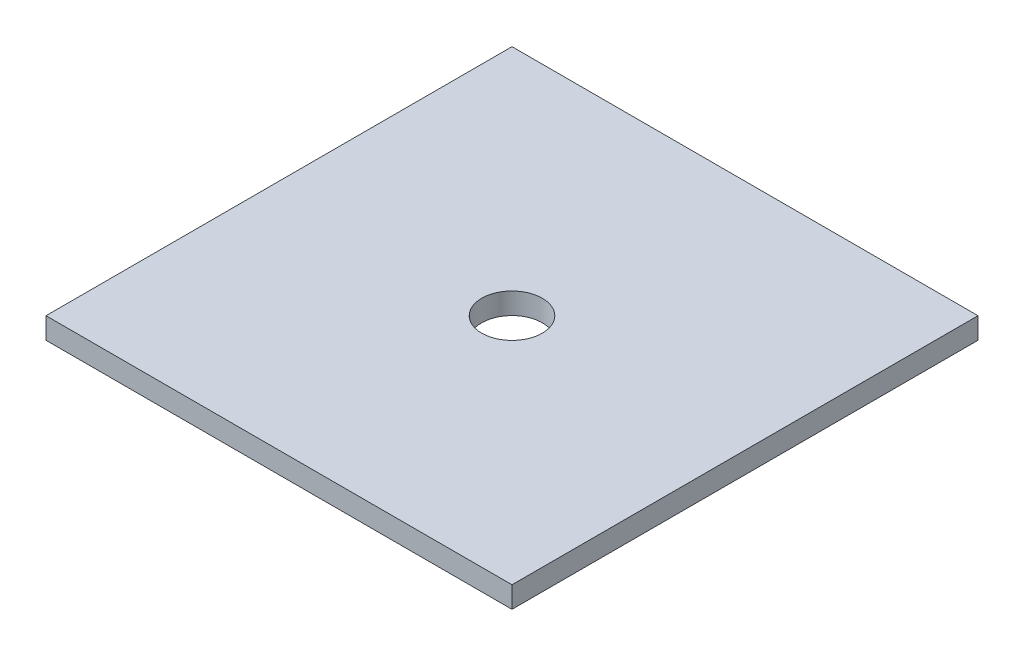
ISO-10303-21;
HEADER;
FILE_DESCRIPTION(('STEP AP214'),'2;1');
FILE_NAME('part.step','',(''),(''),'','','');
FILE_SCHEMA(('AUTOMOTIVE_DESIGN { 1 0 10303 214 1 1 1 1 }'));
ENDSEC;
DATA;
#1=APPLICATION_CONTEXT('core data for automotive mechanical design processes');
#2=APPLICATION_PROTOCOL_DEFINITION('international standard','automotive_design',2000,#1);
#3=PRODUCT_CONTEXT('',#1,'mechanical');
#4=PRODUCT('Part','Part','',(#3));
#5=PRODUCT_RELATED_PRODUCT_CATEGORY('part','',(#4));
#6=PRODUCT_DEFINITION_FORMATION('','',#4);
#7=PRODUCT_DEFINITION_CONTEXT('part definition',#1,'design');
#8=PRODUCT_DEFINITION('design','',#6,#7);
#9=PRODUCT_DEFINITION_SHAPE('','',#8);
#10=(LENGTH_UNIT() NAMED_UNIT(*) SI_UNIT(.MILLI.,.METRE.));
#11=(NAMED_UNIT(*) PLANE_ANGLE_UNIT() SI_UNIT($,.RADIAN.));
#12=(NAMED_UNIT(*) SI_UNIT($,.STERADIAN.) SOLID_ANGLE_UNIT());
#13=UNCERTAINTY_MEASURE_WITH_UNIT(LENGTH_MEASURE(1.E-05),#10,'distance_accuracy_value','');
#14=(GEOMETRIC_REPRESENTATION_CONTEXT(3) GLOBAL_UNCERTAINTY_ASSIGNED_CONTEXT((#13)) GLOBAL_UNIT_ASSIGNED_CONTEXT((#10,
#11,#12)) REPRESENTATION_CONTEXT('',''));
#15=CARTESIAN_POINT('',(0.,0.,0.));
#16=DIRECTION('',(0.,0.,1.));
#17=DIRECTION('',(1.,0.,0.));
#18=AXIS2_PLACEMENT_3D('',#15,#16,#17);
#19=CARTESIAN_POINT('',(0.,16.,0.));
#20=DIRECTION('',(0.,-1.,0.));
#21=DIRECTION('',(0.,0.,-1.));
#22=AXIS2_PLACEMENT_3D('',#19,#20,#21);
#23=PLANE('',#22);
#24=DIRECTION('',(0.,0.,1.));
#25=VECTOR('',#24,1.);
#26=CARTESIAN_POINT('',(-175.,16.,-175.));
#27=LINE('',#26,#25);
#28=CARTESIAN_POINT('',(-175.,16.,-175.));
#29=VERTEX_POINT('',#28);
#30=CARTESIAN_POINT('',(-175.,16.,175.));
#31=VERTEX_POINT('',#30);
#32=EDGE_CURVE('E85',#29,#31,#27,.T.);
#33=ORIENTED_EDGE('',*,*,#32,.T.);
#34=DIRECTION('',(1.,0.,0.));
#35=VECTOR('',#34,1.);
#36=CARTESIAN_POINT('',(175.,16.,175.));
#37=LINE('',#36,#35);
#38=CARTESIAN_POINT('',(175.,16.,175.));
#39=VERTEX_POINT('',#38);
#40=EDGE_CURVE('E80',#31,#39,#37,.T.);
#41=ORIENTED_EDGE('',*,*,#40,.T.);
#42=DIRECTION('',(0.,0.,-1.));
#43=VECTOR('',#42,1.);
#44=CARTESIAN_POINT('',(175.,16.,-175.));
#45=LINE('',#44,#43);
#46=CARTESIAN_POINT('',(175.,16.,-175.));
#47=VERTEX_POINT('',#46);
#48=EDGE_CURVE('E83',#39,#47,#45,.T.);
#49=ORIENTED_EDGE('',*,*,#48,.T.);
#50=DIRECTION('',(-1.,0.,0.));
#51=VECTOR('',#50,1.);
#52=CARTESIAN_POINT('',(175.,16.,-175.));
#53=LINE('',#52,#51);
#54=EDGE_CURVE('E50',#47,#29,#53,.T.);
#55=ORIENTED_EDGE('',*,*,#54,.T.);
#56=EDGE_LOOP('',(#33,#41,#49,#55));
#57=FACE_BOUND('',#56,.T.);
#58=CARTESIAN_POINT('',(0.,16.,0.));
#59=DIRECTION('',(0.,1.,0.));
#60=DIRECTION('',(0.,0.,1.));
#61=AXIS2_PLACEMENT_3D('',#58,#59,#60);
#62=CIRCLE('',#61,22.75);
#63=CARTESIAN_POINT('',(0.,16.,22.75));
#64=VERTEX_POINT('',#63);
#65=EDGE_CURVE('E100',#64,#64,#62,.T.);
#66=ORIENTED_EDGE('',*,*,#65,.F.);
#67=EDGE_LOOP('',(#66));
#68=FACE_BOUND('',#67,.T.);
#69=ADVANCED_FACE('F33',(#57,#68),#23,.F.);
#70=CARTESIAN_POINT('',(0.,0.,0.));
#71=DIRECTION('',(0.,-1.,0.));
#72=DIRECTION('',(0.,0.,-1.));
#73=AXIS2_PLACEMENT_3D('',#70,#71,#72);
#74=PLANE('',#73);
#75=DIRECTION('',(0.,0.,1.));
#76=VECTOR('',#75,1.);
#77=CARTESIAN_POINT('',(-175.,0.,-175.));
#78=LINE('',#77,#76);
#79=CARTESIAN_POINT('',(-175.,0.,-175.));
#80=VERTEX_POINT('',#79);
#81=CARTESIAN_POINT('',(-175.,0.,175.));
#82=VERTEX_POINT('',#81);
#83=EDGE_CURVE('E97',#80,#82,#78,.T.);
#84=ORIENTED_EDGE('',*,*,#83,.F.);
#85=DIRECTION('',(-1.,0.,0.));
#86=VECTOR('',#85,1.);
#87=CARTESIAN_POINT('',(175.,0.,-175.));
#88=LINE('',#87,#86);
#89=CARTESIAN_POINT('',(175.,0.,-175.));
#90=VERTEX_POINT('',#89);
#91=EDGE_CURVE('E73',#90,#80,#88,.T.);
#92=ORIENTED_EDGE('',*,*,#91,.F.);
#93=DIRECTION('',(0.,0.,-1.));
#94=VECTOR('',#93,1.);
#95=CARTESIAN_POINT('',(175.,0.,-175.));
#96=LINE('',#95,#94);
#97=CARTESIAN_POINT('',(175.,0.,175.));
#98=VERTEX_POINT('',#97);
#99=EDGE_CURVE('E67',#98,#90,#96,.T.);
#100=ORIENTED_EDGE('',*,*,#99,.F.);
#101=DIRECTION('',(1.,0.,0.));
#102=VECTOR('',#101,1.);
#103=CARTESIAN_POINT('',(175.,0.,175.));
#104=LINE('',#103,#102);
#105=EDGE_CURVE('E89',#82,#98,#104,.T.);
#106=ORIENTED_EDGE('',*,*,#105,.F.);
#107=EDGE_LOOP('',(#84,#92,#100,#106));
#108=FACE_BOUND('',#107,.T.);
#109=CARTESIAN_POINT('',(0.,0.,0.));
#110=DIRECTION('',(0.,1.,0.));
#111=DIRECTION('',(0.,0.,1.));
#112=AXIS2_PLACEMENT_3D('',#109,#110,#111);
#113=CIRCLE('',#112,22.75);
#114=CARTESIAN_POINT('',(0.,0.,22.75));
#115=VERTEX_POINT('',#114);
#116=EDGE_CURVE('E112',#115,#115,#113,.T.);
#117=ORIENTED_EDGE('',*,*,#116,.T.);
#118=EDGE_LOOP('',(#117));
#119=FACE_BOUND('',#118,.T.);
#120=ADVANCED_FACE('F108',(#108,#119),#74,.T.);
#121=CARTESIAN_POINT('',(-175.,16.,-175.));
#122=DIRECTION('',(1.,0.,0.));
#123=DIRECTION('',(0.,0.,-1.));
#124=AXIS2_PLACEMENT_3D('',#121,#122,#123);
#125=PLANE('',#124);
#126=ORIENTED_EDGE('',*,*,#83,.T.);
#127=DIRECTION('',(0.,-1.,0.));
#128=VECTOR('',#127,1.);
#129=CARTESIAN_POINT('',(-175.,16.,175.));
#130=LINE('',#129,#128);
#131=EDGE_CURVE('E11',#31,#82,#130,.T.);
#132=ORIENTED_EDGE('',*,*,#131,.F.);
#133=ORIENTED_EDGE('',*,*,#32,.F.);
#134=DIRECTION('',(0.,-1.,0.));
#135=VECTOR('',#134,1.);
#136=CARTESIAN_POINT('',(-175.,16.,-175.));
#137=LINE('',#136,#135);
#138=EDGE_CURVE('E93',#29,#80,#137,.T.);
#139=ORIENTED_EDGE('',*,*,#138,.T.);
#140=EDGE_LOOP('',(#126,#132,#133,#139));
#141=FACE_BOUND('',#140,.T.);
#142=ADVANCED_FACE('F35',(#141),#125,.F.);
#143=CARTESIAN_POINT('',(175.,16.,175.));
#144=DIRECTION('',(0.,0.,-1.));
#145=DIRECTION('',(-1.,0.,0.));
#146=AXIS2_PLACEMENT_3D('',#143,#144,#145);
#147=PLANE('',#146);
#148=ORIENTED_EDGE('',*,*,#105,.T.);
#149=DIRECTION('',(0.,-1.,0.));
#150=VECTOR('',#149,1.);
#151=CARTESIAN_POINT('',(175.,16.,175.));
#152=LINE('',#151,#150);
#153=EDGE_CURVE('E42',#39,#98,#152,.T.);
#154=ORIENTED_EDGE('',*,*,#153,.F.);
#155=ORIENTED_EDGE('',*,*,#40,.F.);
#156=ORIENTED_EDGE('',*,*,#131,.T.);
#157=EDGE_LOOP('',(#148,#154,#155,#156));
#158=FACE_BOUND('',#157,.T.);
#159=ADVANCED_FACE('F88',(#158),#147,.F.);
#160=CARTESIAN_POINT('',(175.,16.,-175.));
#161=DIRECTION('',(-1.,0.,0.));
#162=DIRECTION('',(0.,0.,1.));
#163=AXIS2_PLACEMENT_3D('',#160,#161,#162);
#164=PLANE('',#163);
#165=ORIENTED_EDGE('',*,*,#99,.T.);
#166=DIRECTION('',(0.,-1.,0.));
#167=VECTOR('',#166,1.);
#168=CARTESIAN_POINT('',(175.,16.,-175.));
#169=LINE('',#168,#167);
#170=EDGE_CURVE('E90',#47,#90,#169,.T.);
#171=ORIENTED_EDGE('',*,*,#170,.F.);
#172=ORIENTED_EDGE('',*,*,#48,.F.);
#173=ORIENTED_EDGE('',*,*,#153,.T.);
#174=EDGE_LOOP('',(#165,#171,#172,#173));
#175=FACE_BOUND('',#174,.T.);
#176=ADVANCED_FACE('F91',(#175),#164,.F.);
#177=CARTESIAN_POINT('',(175.,16.,-175.));
#178=DIRECTION('',(0.,0.,1.));
#179=DIRECTION('',(1.,0.,0.));
#180=AXIS2_PLACEMENT_3D('',#177,#178,#179);
#181=PLANE('',#180);
#182=ORIENTED_EDGE('',*,*,#91,.T.);
#183=ORIENTED_EDGE('',*,*,#138,.F.);
#184=ORIENTED_EDGE('',*,*,#54,.F.);
#185=ORIENTED_EDGE('',*,*,#170,.T.);
#186=EDGE_LOOP('',(#182,#183,#184,#185));
#187=FACE_BOUND('',#186,.T.);
#188=ADVANCED_FACE('F105',(#187),#181,.F.);
#189=CARTESIAN_POINT('',(0.,16.,0.));
#190=DIRECTION('',(0.,-1.,0.));
#191=DIRECTION('',(0.,0.,-1.));
#192=AXIS2_PLACEMENT_3D('',#189,#190,#191);
#193=CYLINDRICAL_SURFACE('',#192,22.75);
#194=ORIENTED_EDGE('',*,*,#65,.T.);
#195=EDGE_LOOP('',(#194));
#196=FACE_BOUND('',#195,.T.);
#197=ORIENTED_EDGE('',*,*,#116,.F.);
#198=EDGE_LOOP('',(#197));
#199=FACE_BOUND('',#198,.T.);
#200=ADVANCED_FACE('F118',(#196,#199),#193,.F.);
#201=CLOSED_SHELL('',(#69,#120,#142,#159,#176,#188,#200));
#202=MANIFOLD_SOLID_BREP('B2',#201);
#203=ADVANCED_BREP_SHAPE_REPRESENTATION('',(#18,#202),#14);
#204=SHAPE_DEFINITION_REPRESENTATION(#9,#203);
ENDSEC;
END-ISO-10303-21;
